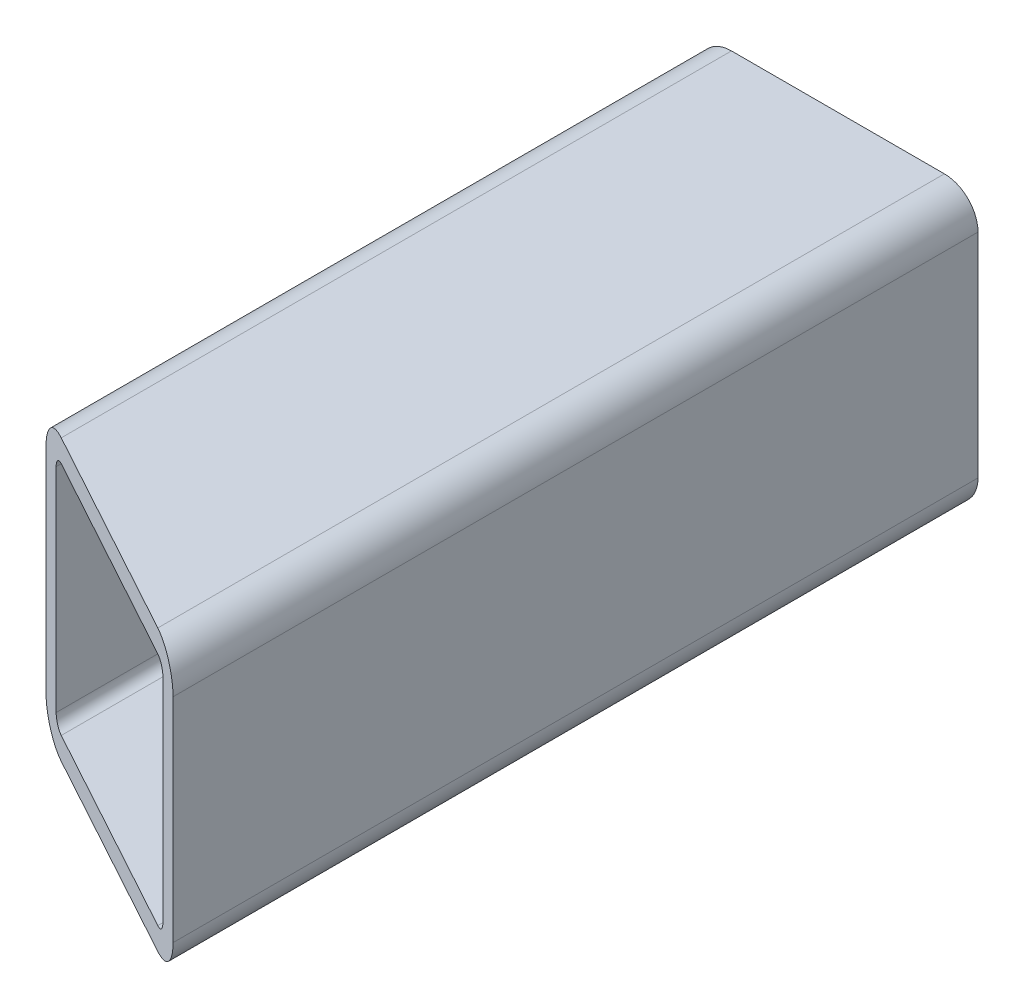
ISO-10303-21;
HEADER;
FILE_DESCRIPTION(('STEP AP214'),'2;1');
FILE_NAME('part.step','',(''),(''),'','','');
FILE_SCHEMA(('AUTOMOTIVE_DESIGN { 1 0 10303 214 1 1 1 1 }'));
ENDSEC;
DATA;
#1=APPLICATION_CONTEXT('core data for automotive mechanical design processes');
#2=APPLICATION_PROTOCOL_DEFINITION('international standard','automotive_design',2000,#1);
#3=PRODUCT_CONTEXT('',#1,'mechanical');
#4=PRODUCT('Part','Part','',(#3));
#5=PRODUCT_RELATED_PRODUCT_CATEGORY('part','',(#4));
#6=PRODUCT_DEFINITION_FORMATION('','',#4);
#7=PRODUCT_DEFINITION_CONTEXT('part definition',#1,'design');
#8=PRODUCT_DEFINITION('design','',#6,#7);
#9=PRODUCT_DEFINITION_SHAPE('','',#8);
#10=(LENGTH_UNIT() NAMED_UNIT(*) SI_UNIT(.MILLI.,.METRE.));
#11=(NAMED_UNIT(*) PLANE_ANGLE_UNIT() SI_UNIT($,.RADIAN.));
#12=(NAMED_UNIT(*) SI_UNIT($,.STERADIAN.) SOLID_ANGLE_UNIT());
#13=UNCERTAINTY_MEASURE_WITH_UNIT(LENGTH_MEASURE(1.E-05),#10,'distance_accuracy_value','');
#14=(GEOMETRIC_REPRESENTATION_CONTEXT(3) GLOBAL_UNCERTAINTY_ASSIGNED_CONTEXT((#13)) GLOBAL_UNIT_ASSIGNED_CONTEXT((#10,
#11,#12)) REPRESENTATION_CONTEXT('',''));
#15=CARTESIAN_POINT('',(0.,0.,0.));
#16=DIRECTION('',(0.,0.,1.));
#17=DIRECTION('',(1.,0.,0.));
#18=AXIS2_PLACEMENT_3D('',#15,#16,#17);
#19=CARTESIAN_POINT('',(0.,0.,0.));
#20=DIRECTION('',(0.,0.,1.));
#21=DIRECTION('',(1.,0.,0.));
#22=AXIS2_PLACEMENT_3D('',#19,#20,#21);
#23=PLANE('',#22);
#24=DIRECTION('',(0.,1.,0.));
#25=VECTOR('',#24,1.);
#26=CARTESIAN_POINT('',(-12.5,-4.75,0.));
#27=LINE('',#26,#25);
#28=CARTESIAN_POINT('',(-12.5,-9.5,0.));
#29=VERTEX_POINT('',#28);
#30=CARTESIAN_POINT('',(-12.5,9.5,0.));
#31=VERTEX_POINT('',#30);
#32=EDGE_CURVE('E245',#29,#31,#27,.T.);
#33=ORIENTED_EDGE('',*,*,#32,.T.);
#34=CARTESIAN_POINT('',(-9.5,9.5,0.));
#35=DIRECTION('',(0.,0.,-1.));
#36=DIRECTION('',(0.,-1.,0.));
#37=AXIS2_PLACEMENT_3D('',#34,#35,#36);
#38=CIRCLE('',#37,3.);
#39=CARTESIAN_POINT('',(-9.5,12.5,0.));
#40=VERTEX_POINT('',#39);
#41=EDGE_CURVE('E259',#31,#40,#38,.T.);
#42=ORIENTED_EDGE('',*,*,#41,.T.);
#43=DIRECTION('',(1.,0.,0.));
#44=VECTOR('',#43,1.);
#45=CARTESIAN_POINT('',(-4.75,12.5,0.));
#46=LINE('',#45,#44);
#47=CARTESIAN_POINT('',(9.5,12.5,0.));
#48=VERTEX_POINT('',#47);
#49=EDGE_CURVE('E183',#40,#48,#46,.T.);
#50=ORIENTED_EDGE('',*,*,#49,.T.);
#51=CARTESIAN_POINT('',(9.5,9.5,0.));
#52=DIRECTION('',(0.,0.,-1.));
#53=DIRECTION('',(-1.,0.,0.));
#54=AXIS2_PLACEMENT_3D('',#51,#52,#53);
#55=CIRCLE('',#54,3.);
#56=CARTESIAN_POINT('',(12.5,9.5,0.));
#57=VERTEX_POINT('',#56);
#58=EDGE_CURVE('E177',#48,#57,#55,.T.);
#59=ORIENTED_EDGE('',*,*,#58,.T.);
#60=DIRECTION('',(0.,-1.,0.));
#61=VECTOR('',#60,1.);
#62=CARTESIAN_POINT('',(12.5,4.75,0.));
#63=LINE('',#62,#61);
#64=CARTESIAN_POINT('',(12.5,-9.5,0.));
#65=VERTEX_POINT('',#64);
#66=EDGE_CURVE('E193',#57,#65,#63,.T.);
#67=ORIENTED_EDGE('',*,*,#66,.T.);
#68=CARTESIAN_POINT('',(9.5,-9.5,0.));
#69=DIRECTION('',(0.,0.,-1.));
#70=DIRECTION('',(0.,1.,0.));
#71=AXIS2_PLACEMENT_3D('',#68,#69,#70);
#72=CIRCLE('',#71,3.);
#73=CARTESIAN_POINT('',(9.5,-12.5,0.));
#74=VERTEX_POINT('',#73);
#75=EDGE_CURVE('E192',#65,#74,#72,.T.);
#76=ORIENTED_EDGE('',*,*,#75,.T.);
#77=DIRECTION('',(-1.,0.,0.));
#78=VECTOR('',#77,1.);
#79=CARTESIAN_POINT('',(4.75,-12.5,0.));
#80=LINE('',#79,#78);
#81=CARTESIAN_POINT('',(-9.5,-12.5,0.));
#82=VERTEX_POINT('',#81);
#83=EDGE_CURVE('E27',#74,#82,#80,.T.);
#84=ORIENTED_EDGE('',*,*,#83,.T.);
#85=CARTESIAN_POINT('',(-9.5,-9.5,0.));
#86=DIRECTION('',(0.,0.,-1.));
#87=DIRECTION('',(1.,0.,0.));
#88=AXIS2_PLACEMENT_3D('',#85,#86,#87);
#89=CIRCLE('',#88,3.);
#90=EDGE_CURVE('E11',#82,#29,#89,.T.);
#91=ORIENTED_EDGE('',*,*,#90,.T.);
#92=EDGE_LOOP('',(#33,#42,#50,#59,#67,#76,#84,#91));
#93=FACE_BOUND('',#92,.T.);
#94=DIRECTION('',(-1.,0.,0.));
#95=VECTOR('',#94,1.);
#96=CARTESIAN_POINT('',(-4.75,10.5,0.));
#97=LINE('',#96,#95);
#98=CARTESIAN_POINT('',(9.5,10.5,0.));
#99=VERTEX_POINT('',#98);
#100=CARTESIAN_POINT('',(-9.5,10.5,0.));
#101=VERTEX_POINT('',#100);
#102=EDGE_CURVE('E145',#99,#101,#97,.T.);
#103=ORIENTED_EDGE('',*,*,#102,.T.);
#104=CARTESIAN_POINT('',(-9.5,9.5,0.));
#105=DIRECTION('',(0.,0.,1.));
#106=DIRECTION('',(0.,-1.,0.));
#107=AXIS2_PLACEMENT_3D('',#104,#105,#106);
#108=CIRCLE('',#107,1.);
#109=CARTESIAN_POINT('',(-10.5,9.5,0.));
#110=VERTEX_POINT('',#109);
#111=EDGE_CURVE('E204',#101,#110,#108,.T.);
#112=ORIENTED_EDGE('',*,*,#111,.T.);
#113=DIRECTION('',(0.,-1.,0.));
#114=VECTOR('',#113,1.);
#115=CARTESIAN_POINT('',(-10.5,-4.75,0.));
#116=LINE('',#115,#114);
#117=CARTESIAN_POINT('',(-10.5,-9.5,0.));
#118=VERTEX_POINT('',#117);
#119=EDGE_CURVE('E203',#110,#118,#116,.T.);
#120=ORIENTED_EDGE('',*,*,#119,.T.);
#121=CARTESIAN_POINT('',(-9.5,-9.5,0.));
#122=DIRECTION('',(0.,0.,1.));
#123=DIRECTION('',(1.,0.,0.));
#124=AXIS2_PLACEMENT_3D('',#121,#122,#123);
#125=CIRCLE('',#124,1.);
#126=CARTESIAN_POINT('',(-9.5,-10.5,0.));
#127=VERTEX_POINT('',#126);
#128=EDGE_CURVE('E205',#118,#127,#125,.T.);
#129=ORIENTED_EDGE('',*,*,#128,.T.);
#130=DIRECTION('',(1.,0.,0.));
#131=VECTOR('',#130,1.);
#132=CARTESIAN_POINT('',(4.75,-10.5,0.));
#133=LINE('',#132,#131);
#134=CARTESIAN_POINT('',(9.5,-10.5,0.));
#135=VERTEX_POINT('',#134);
#136=EDGE_CURVE('E211',#127,#135,#133,.T.);
#137=ORIENTED_EDGE('',*,*,#136,.T.);
#138=CARTESIAN_POINT('',(9.5,-9.5,0.));
#139=DIRECTION('',(0.,0.,1.));
#140=DIRECTION('',(0.,1.,0.));
#141=AXIS2_PLACEMENT_3D('',#138,#139,#140);
#142=CIRCLE('',#141,1.);
#143=CARTESIAN_POINT('',(10.5,-9.5,0.));
#144=VERTEX_POINT('',#143);
#145=EDGE_CURVE('E289',#135,#144,#142,.T.);
#146=ORIENTED_EDGE('',*,*,#145,.T.);
#147=DIRECTION('',(0.,1.,0.));
#148=VECTOR('',#147,1.);
#149=CARTESIAN_POINT('',(10.5,4.75,0.));
#150=LINE('',#149,#148);
#151=CARTESIAN_POINT('',(10.5,9.5,0.));
#152=VERTEX_POINT('',#151);
#153=EDGE_CURVE('E253',#144,#152,#150,.T.);
#154=ORIENTED_EDGE('',*,*,#153,.T.);
#155=CARTESIAN_POINT('',(9.5,9.5,0.));
#156=DIRECTION('',(0.,0.,1.));
#157=DIRECTION('',(-1.,0.,0.));
#158=AXIS2_PLACEMENT_3D('',#155,#156,#157);
#159=CIRCLE('',#158,1.);
#160=EDGE_CURVE('E250',#152,#99,#159,.T.);
#161=ORIENTED_EDGE('',*,*,#160,.T.);
#162=EDGE_LOOP('',(#103,#112,#120,#129,#137,#146,#154,#161));
#163=FACE_BOUND('',#162,.T.);
#164=ADVANCED_FACE('F16',(#93,#163),#23,.F.);
#165=CARTESIAN_POINT('',(-9.5,-9.5,0.));
#166=DIRECTION('',(0.,0.,1.));
#167=DIRECTION('',(1.,0.,0.));
#168=AXIS2_PLACEMENT_3D('',#165,#166,#167);
#169=CYLINDRICAL_SURFACE('',#168,3.);
#170=CARTESIAN_POINT('',(-9.5,-9.5,59.8078223463784));
#171=DIRECTION('',(0.479589430080709,0.,-0.877493007695708));
#172=DIRECTION('',(0.877493007695709,0.,0.479589430080709));
#173=AXIS2_PLACEMENT_3D('',#170,#171,#172);
#174=ELLIPSE('',#173,3.41883066154337,3.);
#175=CARTESIAN_POINT('',(-9.5,-12.5,59.8078223463784));
#176=VERTEX_POINT('',#175);
#177=CARTESIAN_POINT('',(-12.5,-9.5,58.1681872978664));
#178=VERTEX_POINT('',#177);
#179=EDGE_CURVE('E228',#176,#178,#174,.T.);
#180=ORIENTED_EDGE('',*,*,#179,.T.);
#181=DIRECTION('',(0.,0.,1.));
#182=VECTOR('',#181,1.);
#183=CARTESIAN_POINT('',(-12.5,-9.5,0.));
#184=LINE('',#183,#182);
#185=EDGE_CURVE('E249',#29,#178,#184,.T.);
#186=ORIENTED_EDGE('',*,*,#185,.F.);
#187=ORIENTED_EDGE('',*,*,#90,.F.);
#188=DIRECTION('',(0.,0.,1.));
#189=VECTOR('',#188,1.);
#190=CARTESIAN_POINT('',(-9.5,-12.5,0.));
#191=LINE('',#190,#189);
#192=EDGE_CURVE('E196',#82,#176,#191,.T.);
#193=ORIENTED_EDGE('',*,*,#192,.T.);
#194=EDGE_LOOP('',(#180,#186,#187,#193));
#195=FACE_BOUND('',#194,.T.);
#196=ADVANCED_FACE('F531',(#195),#169,.T.);
#197=CARTESIAN_POINT('',(9.5,-12.5,0.));
#198=DIRECTION('',(0.,-1.,0.));
#199=DIRECTION('',(0.,0.,-1.));
#200=AXIS2_PLACEMENT_3D('',#197,#198,#199);
#201=PLANE('',#200);
#202=DIRECTION('',(-0.877493007695708,0.,-0.479589430080709));
#203=VECTOR('',#202,1.);
#204=CARTESIAN_POINT('',(-23.6968927468028,-12.5,52.0485813705037));
#205=LINE('',#204,#203);
#206=CARTESIAN_POINT('',(9.5,-12.5,70.1921776536214));
#207=VERTEX_POINT('',#206);
#208=EDGE_CURVE('E223',#207,#176,#205,.T.);
#209=ORIENTED_EDGE('',*,*,#208,.T.);
#210=ORIENTED_EDGE('',*,*,#192,.F.);
#211=ORIENTED_EDGE('',*,*,#83,.F.);
#212=DIRECTION('',(0.,0.,1.));
#213=VECTOR('',#212,1.);
#214=CARTESIAN_POINT('',(9.5,-12.5,0.));
#215=LINE('',#214,#213);
#216=EDGE_CURVE('E188',#74,#207,#215,.T.);
#217=ORIENTED_EDGE('',*,*,#216,.T.);
#218=EDGE_LOOP('',(#209,#210,#211,#217));
#219=FACE_BOUND('',#218,.T.);
#220=ADVANCED_FACE('F522',(#219),#201,.T.);
#221=CARTESIAN_POINT('',(9.5,-9.5,0.));
#222=DIRECTION('',(0.,0.,1.));
#223=DIRECTION('',(0.,1.,0.));
#224=AXIS2_PLACEMENT_3D('',#221,#222,#223);
#225=CYLINDRICAL_SURFACE('',#224,3.);
#226=CARTESIAN_POINT('',(9.5,-9.5,70.1921776536214));
#227=DIRECTION('',(0.479589430080709,0.,-0.877493007695708));
#228=DIRECTION('',(-0.877493007695709,0.,-0.479589430080709));
#229=AXIS2_PLACEMENT_3D('',#226,#227,#228);
#230=ELLIPSE('',#229,3.41883066154337,3.);
#231=CARTESIAN_POINT('',(12.5,-9.5,71.8318127021334));
#232=VERTEX_POINT('',#231);
#233=EDGE_CURVE('E227',#232,#207,#230,.T.);
#234=ORIENTED_EDGE('',*,*,#233,.T.);
#235=ORIENTED_EDGE('',*,*,#216,.F.);
#236=ORIENTED_EDGE('',*,*,#75,.F.);
#237=DIRECTION('',(0.,0.,1.));
#238=VECTOR('',#237,1.);
#239=CARTESIAN_POINT('',(12.5,-9.5,0.));
#240=LINE('',#239,#238);
#241=EDGE_CURVE('E222',#65,#232,#240,.T.);
#242=ORIENTED_EDGE('',*,*,#241,.T.);
#243=EDGE_LOOP('',(#234,#235,#236,#242));
#244=FACE_BOUND('',#243,.T.);
#245=ADVANCED_FACE('F513',(#244),#225,.T.);
#246=CARTESIAN_POINT('',(12.5,9.5,0.));
#247=DIRECTION('',(1.,0.,0.));
#248=DIRECTION('',(0.,1.,0.));
#249=AXIS2_PLACEMENT_3D('',#246,#247,#248);
#250=PLANE('',#249);
#251=DIRECTION('',(0.,-1.,0.));
#252=VECTOR('',#251,1.);
#253=CARTESIAN_POINT('',(12.5,4.75,71.8318127021334));
#254=LINE('',#253,#252);
#255=CARTESIAN_POINT('',(12.5,9.5,71.8318127021334));
#256=VERTEX_POINT('',#255);
#257=EDGE_CURVE('E232',#256,#232,#254,.T.);
#258=ORIENTED_EDGE('',*,*,#257,.T.);
#259=ORIENTED_EDGE('',*,*,#241,.F.);
#260=ORIENTED_EDGE('',*,*,#66,.F.);
#261=DIRECTION('',(0.,0.,1.));
#262=VECTOR('',#261,1.);
#263=CARTESIAN_POINT('',(12.5,9.5,0.));
#264=LINE('',#263,#262);
#265=EDGE_CURVE('E182',#57,#256,#264,.T.);
#266=ORIENTED_EDGE('',*,*,#265,.T.);
#267=EDGE_LOOP('',(#258,#259,#260,#266));
#268=FACE_BOUND('',#267,.T.);
#269=ADVANCED_FACE('F460',(#268),#250,.T.);
#270=CARTESIAN_POINT('',(9.5,9.5,0.));
#271=DIRECTION('',(0.,0.,1.));
#272=DIRECTION('',(-1.,0.,0.));
#273=AXIS2_PLACEMENT_3D('',#270,#271,#272);
#274=CYLINDRICAL_SURFACE('',#273,1.);
#275=CARTESIAN_POINT('',(9.5,9.5,70.1921776536214));
#276=DIRECTION('',(-0.479589430080709,0.,0.877493007695709));
#277=DIRECTION('',(-0.877493007695709,0.,-0.479589430080709));
#278=AXIS2_PLACEMENT_3D('',#275,#276,#277);
#279=ELLIPSE('',#278,1.13961022051446,1.);
#280=CARTESIAN_POINT('',(10.5,9.5,70.738722669792));
#281=VERTEX_POINT('',#280);
#282=CARTESIAN_POINT('',(9.5,10.5,70.1921776536214));
#283=VERTEX_POINT('',#282);
#284=EDGE_CURVE('E20',#281,#283,#279,.T.);
#285=ORIENTED_EDGE('',*,*,#284,.T.);
#286=DIRECTION('',(0.,0.,1.));
#287=VECTOR('',#286,1.);
#288=CARTESIAN_POINT('',(9.5,10.5,0.));
#289=LINE('',#288,#287);
#290=EDGE_CURVE('E137',#99,#283,#289,.T.);
#291=ORIENTED_EDGE('',*,*,#290,.F.);
#292=ORIENTED_EDGE('',*,*,#160,.F.);
#293=DIRECTION('',(0.,0.,1.));
#294=VECTOR('',#293,1.);
#295=CARTESIAN_POINT('',(10.5,9.5,0.));
#296=LINE('',#295,#294);
#297=EDGE_CURVE('E154',#152,#281,#296,.T.);
#298=ORIENTED_EDGE('',*,*,#297,.T.);
#299=EDGE_LOOP('',(#285,#291,#292,#298));
#300=FACE_BOUND('',#299,.T.);
#301=ADVANCED_FACE('F152',(#300),#274,.F.);
#302=CARTESIAN_POINT('',(10.5,9.5,0.));
#303=DIRECTION('',(1.,0.,0.));
#304=DIRECTION('',(0.,-1.,0.));
#305=AXIS2_PLACEMENT_3D('',#302,#303,#304);
#306=PLANE('',#305);
#307=DIRECTION('',(0.,1.,0.));
#308=VECTOR('',#307,1.);
#309=CARTESIAN_POINT('',(10.5,4.75,70.738722669792));
#310=LINE('',#309,#308);
#311=CARTESIAN_POINT('',(10.5,-9.5,70.738722669792));
#312=VERTEX_POINT('',#311);
#313=EDGE_CURVE('E159',#312,#281,#310,.T.);
#314=ORIENTED_EDGE('',*,*,#313,.T.);
#315=ORIENTED_EDGE('',*,*,#297,.F.);
#316=ORIENTED_EDGE('',*,*,#153,.F.);
#317=DIRECTION('',(0.,0.,1.));
#318=VECTOR('',#317,1.);
#319=CARTESIAN_POINT('',(10.5,-9.5,0.));
#320=LINE('',#319,#318);
#321=EDGE_CURVE('E215',#144,#312,#320,.T.);
#322=ORIENTED_EDGE('',*,*,#321,.T.);
#323=EDGE_LOOP('',(#314,#315,#316,#322));
#324=FACE_BOUND('',#323,.T.);
#325=ADVANCED_FACE('F312',(#324),#306,.F.);
#326=CARTESIAN_POINT('',(9.5,-9.5,0.));
#327=DIRECTION('',(0.,0.,1.));
#328=DIRECTION('',(0.,1.,0.));
#329=AXIS2_PLACEMENT_3D('',#326,#327,#328);
#330=CYLINDRICAL_SURFACE('',#329,1.);
#331=CARTESIAN_POINT('',(9.5,-9.5,70.1921776536214));
#332=DIRECTION('',(-0.479589430080709,0.,0.877493007695709));
#333=DIRECTION('',(-0.877493007695709,0.,-0.479589430080709));
#334=AXIS2_PLACEMENT_3D('',#331,#332,#333);
#335=ELLIPSE('',#334,1.13961022051446,1.);
#336=CARTESIAN_POINT('',(9.5,-10.5,70.1921776536214));
#337=VERTEX_POINT('',#336);
#338=EDGE_CURVE('E199',#337,#312,#335,.T.);
#339=ORIENTED_EDGE('',*,*,#338,.T.);
#340=ORIENTED_EDGE('',*,*,#321,.F.);
#341=ORIENTED_EDGE('',*,*,#145,.F.);
#342=DIRECTION('',(0.,0.,1.));
#343=VECTOR('',#342,1.);
#344=CARTESIAN_POINT('',(9.5,-10.5,0.));
#345=LINE('',#344,#343);
#346=EDGE_CURVE('E181',#135,#337,#345,.T.);
#347=ORIENTED_EDGE('',*,*,#346,.T.);
#348=EDGE_LOOP('',(#339,#340,#341,#347));
#349=FACE_BOUND('',#348,.T.);
#350=ADVANCED_FACE('F482',(#349),#330,.F.);
#351=CARTESIAN_POINT('',(9.5,-10.5,0.));
#352=DIRECTION('',(0.,-1.,0.));
#353=DIRECTION('',(0.,0.,-1.));
#354=AXIS2_PLACEMENT_3D('',#351,#352,#353);
#355=PLANE('',#354);
#356=DIRECTION('',(0.877493007695708,0.,0.479589430080709));
#357=VECTOR('',#356,1.);
#358=CARTESIAN_POINT('',(-23.6968927468029,-10.5,52.0485813705037));
#359=LINE('',#358,#357);
#360=CARTESIAN_POINT('',(-9.5,-10.5,59.8078223463784));
#361=VERTEX_POINT('',#360);
#362=EDGE_CURVE('E258',#361,#337,#359,.T.);
#363=ORIENTED_EDGE('',*,*,#362,.T.);
#364=ORIENTED_EDGE('',*,*,#346,.F.);
#365=ORIENTED_EDGE('',*,*,#136,.F.);
#366=DIRECTION('',(0.,0.,1.));
#367=VECTOR('',#366,1.);
#368=CARTESIAN_POINT('',(-9.5,-10.5,0.));
#369=LINE('',#368,#367);
#370=EDGE_CURVE('E210',#127,#361,#369,.T.);
#371=ORIENTED_EDGE('',*,*,#370,.T.);
#372=EDGE_LOOP('',(#363,#364,#365,#371));
#373=FACE_BOUND('',#372,.T.);
#374=ADVANCED_FACE('F322',(#373),#355,.F.);
#375=CARTESIAN_POINT('',(9.5,9.5,0.));
#376=DIRECTION('',(0.,0.,1.));
#377=DIRECTION('',(-1.,0.,0.));
#378=AXIS2_PLACEMENT_3D('',#375,#376,#377);
#379=CYLINDRICAL_SURFACE('',#378,3.);
#380=CARTESIAN_POINT('',(9.5,9.5,70.1921776536214));
#381=DIRECTION('',(0.479589430080709,0.,-0.877493007695708));
#382=DIRECTION('',(-0.877493007695709,0.,-0.479589430080709));
#383=AXIS2_PLACEMENT_3D('',#380,#381,#382);
#384=ELLIPSE('',#383,3.41883066154337,3.);
#385=CARTESIAN_POINT('',(9.5,12.5,70.1921776536214));
#386=VERTEX_POINT('',#385);
#387=EDGE_CURVE('E236',#386,#256,#384,.T.);
#388=ORIENTED_EDGE('',*,*,#387,.T.);
#389=ORIENTED_EDGE('',*,*,#265,.F.);
#390=ORIENTED_EDGE('',*,*,#58,.F.);
#391=DIRECTION('',(0.,0.,1.));
#392=VECTOR('',#391,1.);
#393=CARTESIAN_POINT('',(9.5,12.5,0.));
#394=LINE('',#393,#392);
#395=EDGE_CURVE('E186',#48,#386,#394,.T.);
#396=ORIENTED_EDGE('',*,*,#395,.T.);
#397=EDGE_LOOP('',(#388,#389,#390,#396));
#398=FACE_BOUND('',#397,.T.);
#399=ADVANCED_FACE('F18',(#398),#379,.T.);
#400=CARTESIAN_POINT('',(-9.5,12.5,0.));
#401=DIRECTION('',(0.,1.,0.));
#402=DIRECTION('',(1.,0.,0.));
#403=AXIS2_PLACEMENT_3D('',#400,#401,#402);
#404=PLANE('',#403);
#405=DIRECTION('',(0.877493007695708,0.,0.479589430080709));
#406=VECTOR('',#405,1.);
#407=CARTESIAN_POINT('',(-31.011835543074,12.5,48.0506358416281));
#408=LINE('',#407,#406);
#409=CARTESIAN_POINT('',(-9.5,12.5,59.8078223463784));
#410=VERTEX_POINT('',#409);
#411=EDGE_CURVE('E269',#410,#386,#408,.T.);
#412=ORIENTED_EDGE('',*,*,#411,.T.);
#413=ORIENTED_EDGE('',*,*,#395,.F.);
#414=ORIENTED_EDGE('',*,*,#49,.F.);
#415=DIRECTION('',(0.,0.,1.));
#416=VECTOR('',#415,1.);
#417=CARTESIAN_POINT('',(-9.5,12.5,0.));
#418=LINE('',#417,#416);
#419=EDGE_CURVE('E263',#40,#410,#418,.T.);
#420=ORIENTED_EDGE('',*,*,#419,.T.);
#421=EDGE_LOOP('',(#412,#413,#414,#420));
#422=FACE_BOUND('',#421,.T.);
#423=ADVANCED_FACE('F361',(#422),#404,.T.);
#424=CARTESIAN_POINT('',(-9.5,9.5,0.));
#425=DIRECTION('',(0.,0.,1.));
#426=DIRECTION('',(0.,-1.,0.));
#427=AXIS2_PLACEMENT_3D('',#424,#425,#426);
#428=CYLINDRICAL_SURFACE('',#427,3.);
#429=CARTESIAN_POINT('',(-9.5,9.5,59.8078223463784));
#430=DIRECTION('',(0.479589430080709,0.,-0.877493007695708));
#431=DIRECTION('',(0.877493007695709,0.,0.479589430080709));
#432=AXIS2_PLACEMENT_3D('',#429,#430,#431);
#433=ELLIPSE('',#432,3.41883066154337,3.);
#434=CARTESIAN_POINT('',(-12.5,9.5,58.1681872978664));
#435=VERTEX_POINT('',#434);
#436=EDGE_CURVE('E277',#435,#410,#433,.T.);
#437=ORIENTED_EDGE('',*,*,#436,.T.);
#438=ORIENTED_EDGE('',*,*,#419,.F.);
#439=ORIENTED_EDGE('',*,*,#41,.F.);
#440=DIRECTION('',(0.,0.,1.));
#441=VECTOR('',#440,1.);
#442=CARTESIAN_POINT('',(-12.5,9.5,0.));
#443=LINE('',#442,#441);
#444=EDGE_CURVE('E209',#31,#435,#443,.T.);
#445=ORIENTED_EDGE('',*,*,#444,.T.);
#446=EDGE_LOOP('',(#437,#438,#439,#445));
#447=FACE_BOUND('',#446,.T.);
#448=ADVANCED_FACE('F499',(#447),#428,.T.);
#449=CARTESIAN_POINT('',(-12.5,-9.5,0.));
#450=DIRECTION('',(-1.,0.,0.));
#451=DIRECTION('',(0.,1.,0.));
#452=AXIS2_PLACEMENT_3D('',#449,#450,#451);
#453=PLANE('',#452);
#454=DIRECTION('',(0.,1.,0.));
#455=VECTOR('',#454,1.);
#456=CARTESIAN_POINT('',(-12.5,-4.75,58.1681872978664));
#457=LINE('',#456,#455);
#458=EDGE_CURVE('E175',#178,#435,#457,.T.);
#459=ORIENTED_EDGE('',*,*,#458,.T.);
#460=ORIENTED_EDGE('',*,*,#444,.F.);
#461=ORIENTED_EDGE('',*,*,#32,.F.);
#462=ORIENTED_EDGE('',*,*,#185,.T.);
#463=EDGE_LOOP('',(#459,#460,#461,#462));
#464=FACE_BOUND('',#463,.T.);
#465=ADVANCED_FACE('F353',(#464),#453,.T.);
#466=CARTESIAN_POINT('',(-9.5,-9.5,0.));
#467=DIRECTION('',(0.,0.,1.));
#468=DIRECTION('',(1.,0.,0.));
#469=AXIS2_PLACEMENT_3D('',#466,#467,#468);
#470=CYLINDRICAL_SURFACE('',#469,1.);
#471=CARTESIAN_POINT('',(-9.5,-9.5,59.8078223463784));
#472=DIRECTION('',(-0.479589430080709,0.,0.877493007695709));
#473=DIRECTION('',(0.877493007695709,0.,0.479589430080709));
#474=AXIS2_PLACEMENT_3D('',#471,#472,#473);
#475=ELLIPSE('',#474,1.13961022051446,1.);
#476=CARTESIAN_POINT('',(-10.5,-9.5,59.2612773302078));
#477=VERTEX_POINT('',#476);
#478=EDGE_CURVE('E254',#477,#361,#475,.T.);
#479=ORIENTED_EDGE('',*,*,#478,.T.);
#480=ORIENTED_EDGE('',*,*,#370,.F.);
#481=ORIENTED_EDGE('',*,*,#128,.F.);
#482=DIRECTION('',(0.,0.,1.));
#483=VECTOR('',#482,1.);
#484=CARTESIAN_POINT('',(-10.5,-9.5,0.));
#485=LINE('',#484,#483);
#486=EDGE_CURVE('E200',#118,#477,#485,.T.);
#487=ORIENTED_EDGE('',*,*,#486,.T.);
#488=EDGE_LOOP('',(#479,#480,#481,#487));
#489=FACE_BOUND('',#488,.T.);
#490=ADVANCED_FACE('F327',(#489),#470,.F.);
#491=CARTESIAN_POINT('',(-10.5,-9.5,0.));
#492=DIRECTION('',(-1.,0.,0.));
#493=DIRECTION('',(0.,0.,1.));
#494=AXIS2_PLACEMENT_3D('',#491,#492,#493);
#495=PLANE('',#494);
#496=DIRECTION('',(0.,-1.,0.));
#497=VECTOR('',#496,1.);
#498=CARTESIAN_POINT('',(-10.5,-4.75,59.2612773302078));
#499=LINE('',#498,#497);
#500=CARTESIAN_POINT('',(-10.5,9.5,59.2612773302078));
#501=VERTEX_POINT('',#500);
#502=EDGE_CURVE('E171',#501,#477,#499,.T.);
#503=ORIENTED_EDGE('',*,*,#502,.T.);
#504=ORIENTED_EDGE('',*,*,#486,.F.);
#505=ORIENTED_EDGE('',*,*,#119,.F.);
#506=DIRECTION('',(0.,0.,1.));
#507=VECTOR('',#506,1.);
#508=CARTESIAN_POINT('',(-10.5,9.5,0.));
#509=LINE('',#508,#507);
#510=EDGE_CURVE('E149',#110,#501,#509,.T.);
#511=ORIENTED_EDGE('',*,*,#510,.T.);
#512=EDGE_LOOP('',(#503,#504,#505,#511));
#513=FACE_BOUND('',#512,.T.);
#514=ADVANCED_FACE('F471',(#513),#495,.F.);
#515=CARTESIAN_POINT('',(-9.5,9.5,0.));
#516=DIRECTION('',(0.,0.,1.));
#517=DIRECTION('',(0.,-1.,0.));
#518=AXIS2_PLACEMENT_3D('',#515,#516,#517);
#519=CYLINDRICAL_SURFACE('',#518,1.);
#520=CARTESIAN_POINT('',(-9.5,9.5,59.8078223463784));
#521=DIRECTION('',(-0.479589430080709,0.,0.877493007695709));
#522=DIRECTION('',(0.877493007695709,0.,0.479589430080709));
#523=AXIS2_PLACEMENT_3D('',#520,#521,#522);
#524=ELLIPSE('',#523,1.13961022051446,1.);
#525=CARTESIAN_POINT('',(-9.5,10.5,59.8078223463784));
#526=VERTEX_POINT('',#525);
#527=EDGE_CURVE('E164',#526,#501,#524,.T.);
#528=ORIENTED_EDGE('',*,*,#527,.T.);
#529=ORIENTED_EDGE('',*,*,#510,.F.);
#530=ORIENTED_EDGE('',*,*,#111,.F.);
#531=DIRECTION('',(0.,0.,1.));
#532=VECTOR('',#531,1.);
#533=CARTESIAN_POINT('',(-9.5,10.5,0.));
#534=LINE('',#533,#532);
#535=EDGE_CURVE('E229',#101,#526,#534,.T.);
#536=ORIENTED_EDGE('',*,*,#535,.T.);
#537=EDGE_LOOP('',(#528,#529,#530,#536));
#538=FACE_BOUND('',#537,.T.);
#539=ADVANCED_FACE('F466',(#538),#519,.F.);
#540=CARTESIAN_POINT('',(-9.5,10.5,0.));
#541=DIRECTION('',(0.,1.,0.));
#542=DIRECTION('',(1.,0.,0.));
#543=AXIS2_PLACEMENT_3D('',#540,#541,#542);
#544=PLANE('',#543);
#545=DIRECTION('',(-0.877493007695708,0.,-0.479589430080709));
#546=VECTOR('',#545,1.);
#547=CARTESIAN_POINT('',(-31.011835543074,10.5,48.0506358416281));
#548=LINE('',#547,#546);
#549=EDGE_CURVE('E142',#283,#526,#548,.T.);
#550=ORIENTED_EDGE('',*,*,#549,.T.);
#551=ORIENTED_EDGE('',*,*,#535,.F.);
#552=ORIENTED_EDGE('',*,*,#102,.F.);
#553=ORIENTED_EDGE('',*,*,#290,.T.);
#554=EDGE_LOOP('',(#550,#551,#552,#553));
#555=FACE_BOUND('',#554,.T.);
#556=ADVANCED_FACE('F139',(#555),#544,.F.);
#557=CARTESIAN_POINT('',(-27.3543641449384,0.,50.0496086060659));
#558=DIRECTION('',(0.479589430080709,0.,-0.877493007695709));
#559=DIRECTION('',(0.,-1.,0.));
#560=AXIS2_PLACEMENT_3D('',#557,#558,#559);
#561=PLANE('',#560);
#562=ORIENTED_EDGE('',*,*,#257,.F.);
#563=ORIENTED_EDGE('',*,*,#387,.F.);
#564=ORIENTED_EDGE('',*,*,#411,.F.);
#565=ORIENTED_EDGE('',*,*,#436,.F.);
#566=ORIENTED_EDGE('',*,*,#458,.F.);
#567=ORIENTED_EDGE('',*,*,#179,.F.);
#568=ORIENTED_EDGE('',*,*,#208,.F.);
#569=ORIENTED_EDGE('',*,*,#233,.F.);
#570=EDGE_LOOP('',(#562,#563,#564,#565,#566,#567,#568,#569));
#571=FACE_BOUND('',#570,.T.);
#572=ORIENTED_EDGE('',*,*,#362,.F.);
#573=ORIENTED_EDGE('',*,*,#478,.F.);
#574=ORIENTED_EDGE('',*,*,#502,.F.);
#575=ORIENTED_EDGE('',*,*,#527,.F.);
#576=ORIENTED_EDGE('',*,*,#549,.F.);
#577=ORIENTED_EDGE('',*,*,#284,.F.);
#578=ORIENTED_EDGE('',*,*,#313,.F.);
#579=ORIENTED_EDGE('',*,*,#338,.F.);
#580=EDGE_LOOP('',(#572,#573,#574,#575,#576,#577,#578,#579));
#581=FACE_BOUND('',#580,.T.);
#582=ADVANCED_FACE('F161',(#571,#581),#561,.F.);
#583=CLOSED_SHELL('',(#164,#196,#220,#245,#269,#301,#325,#350,#374,#399,#423,#448,#465,#490,
#514,#539,#556,#582));
#584=MANIFOLD_SOLID_BREP('B1',#583);
#585=ADVANCED_BREP_SHAPE_REPRESENTATION('',(#18,#584),#14);
#586=SHAPE_DEFINITION_REPRESENTATION(#9,#585);
ENDSEC;
END-ISO-10303-21;
